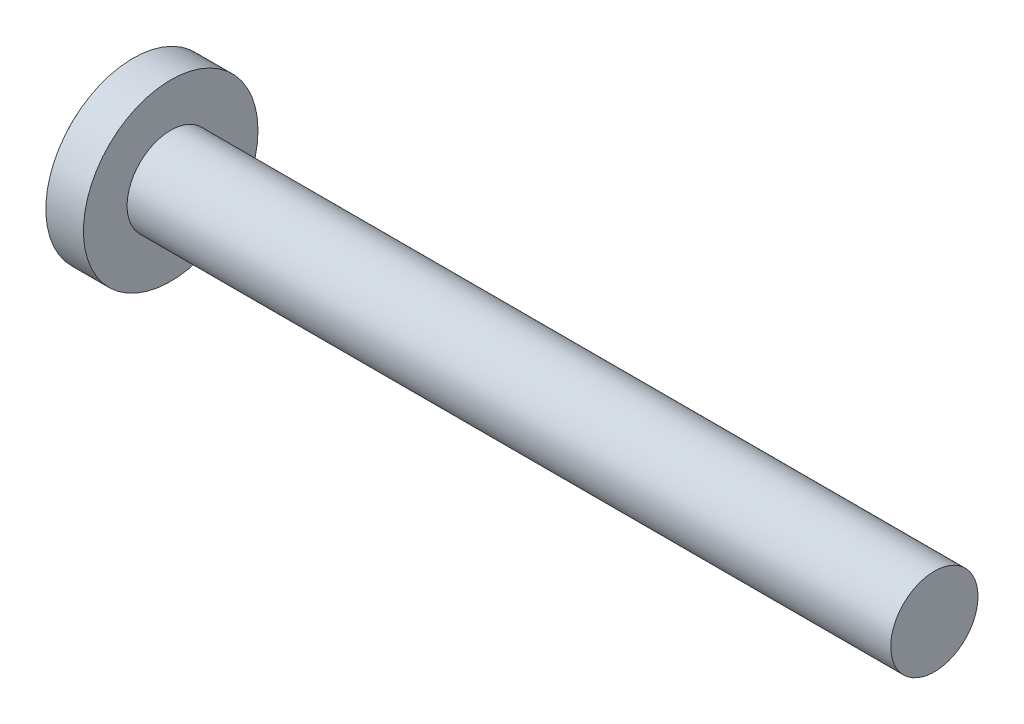
ISO-10303-21;
HEADER;
FILE_DESCRIPTION(('STEP AP214'),'2;1');
FILE_NAME('part.step','',(''),(''),'','','');
FILE_SCHEMA(('AUTOMOTIVE_DESIGN { 1 0 10303 214 1 1 1 1 }'));
ENDSEC;
DATA;
#1=APPLICATION_CONTEXT('core data for automotive mechanical design processes');
#2=APPLICATION_PROTOCOL_DEFINITION('international standard','automotive_design',2000,#1);
#3=PRODUCT_CONTEXT('',#1,'mechanical');
#4=PRODUCT('Part','Part','',(#3));
#5=PRODUCT_RELATED_PRODUCT_CATEGORY('part','',(#4));
#6=PRODUCT_DEFINITION_FORMATION('','',#4);
#7=PRODUCT_DEFINITION_CONTEXT('part definition',#1,'design');
#8=PRODUCT_DEFINITION('design','',#6,#7);
#9=PRODUCT_DEFINITION_SHAPE('','',#8);
#10=(LENGTH_UNIT() NAMED_UNIT(*) SI_UNIT(.MILLI.,.METRE.));
#11=(NAMED_UNIT(*) PLANE_ANGLE_UNIT() SI_UNIT($,.RADIAN.));
#12=(NAMED_UNIT(*) SI_UNIT($,.STERADIAN.) SOLID_ANGLE_UNIT());
#13=UNCERTAINTY_MEASURE_WITH_UNIT(LENGTH_MEASURE(1.E-05),#10,'distance_accuracy_value','');
#14=(GEOMETRIC_REPRESENTATION_CONTEXT(3) GLOBAL_UNCERTAINTY_ASSIGNED_CONTEXT((#13)) GLOBAL_UNIT_ASSIGNED_CONTEXT((#10,
#11,#12)) REPRESENTATION_CONTEXT('',''));
#15=CARTESIAN_POINT('',(0.,0.,0.));
#16=DIRECTION('',(0.,0.,1.));
#17=DIRECTION('',(1.,0.,0.));
#18=AXIS2_PLACEMENT_3D('',#15,#16,#17);
#19=CARTESIAN_POINT('',(6.5,0.,0.));
#20=DIRECTION('',(1.,0.,0.));
#21=DIRECTION('',(0.,1.,0.));
#22=AXIS2_PLACEMENT_3D('',#19,#20,#21);
#23=SPHERICAL_SURFACE('',#22,6.5);
#24=CARTESIAN_POINT('',(1.3765246170202,0.,0.));
#25=DIRECTION('',(1.,0.,0.));
#26=DIRECTION('',(0.,0.,-1.));
#27=AXIS2_PLACEMENT_3D('',#24,#25,#26);
#28=CIRCLE('',#27,4.);
#29=CARTESIAN_POINT('',(1.3765246170202,0.,-4.));
#30=VERTEX_POINT('',#29);
#31=EDGE_CURVE('E152',#30,#30,#28,.T.);
#32=ORIENTED_EDGE('',*,*,#31,.F.);
#33=EDGE_LOOP('',(#32));
#34=FACE_BOUND('',#33,.T.);
#35=CARTESIAN_POINT('',(6.5,-0.44,0.));
#36=DIRECTION('',(0.,1.,0.));
#37=DIRECTION('',(0.,0.,1.));
#38=AXIS2_PLACEMENT_3D('',#35,#36,#37);
#39=CIRCLE('',#38,6.48509059304494);
#40=CARTESIAN_POINT('',(0.333444887912563,-0.440000000000001,2.00748550420378));
#41=VERTEX_POINT('',#40);
#42=CARTESIAN_POINT('',(0.0572676603788676,-0.44,0.74));
#43=VERTEX_POINT('',#42);
#44=EDGE_CURVE('E235',#41,#43,#39,.F.);
#45=ORIENTED_EDGE('',*,*,#44,.T.);
#46=CARTESIAN_POINT('',(0.0572676603788676,-0.44,0.74));
#47=CARTESIAN_POINT('',(0.0553459095034022,-0.439985341253235,0.72328305296714));
#48=CARTESIAN_POINT('',(0.0535867486844841,-0.441396550947806,0.706548480277779));
#49=CARTESIAN_POINT('',(0.0504373840847348,-0.446984059228203,0.673519044256814));
#50=CARTESIAN_POINT('',(0.0490470236842149,-0.451159181412456,0.657223996920084));
#51=CARTESIAN_POINT('',(0.046676420761246,-0.462192225889046,0.625521412589929));
#52=CARTESIAN_POINT('',(0.0456964933382919,-0.469052201622536,0.610114565285909));
#53=CARTESIAN_POINT('',(0.0441774835674314,-0.485262357640217,0.580654009149766));
#54=CARTESIAN_POINT('',(0.0436382629946529,-0.494611755912349,0.566599877268183));
#55=CARTESIAN_POINT('',(0.0430188919704429,-0.515464220625997,0.540343256526173));
#56=CARTESIAN_POINT('',(0.0429355253534814,-0.526951606000225,0.528128388224688));
#57=CARTESIAN_POINT('',(0.0432217527040643,-0.551797332001338,0.505780157883181));
#58=CARTESIAN_POINT('',(0.0435914161120777,-0.565155959174266,0.49564711522353));
#59=CARTESIAN_POINT('',(0.0447707140747336,-0.593313108529131,0.477778249110346));
#60=CARTESIAN_POINT('',(0.0455789968290611,-0.608107092571906,0.470035174343328));
#61=CARTESIAN_POINT('',(0.0476108904953499,-0.638747141176103,0.457114889529338));
#62=CARTESIAN_POINT('',(0.0488343419884252,-0.65459280003348,0.451936696478722));
#63=CARTESIAN_POINT('',(0.0512407906304834,-0.682094193797786,0.445409618854467));
#64=CARTESIAN_POINT('',(0.052328597772935,-0.693602036355864,0.443380984422657));
#65=CARTESIAN_POINT('',(0.0546743160010176,-0.716741634082106,0.440676069271593));
#66=CARTESIAN_POINT('',(0.0559319812556679,-0.728373188198784,0.439997856052776));
#67=CARTESIAN_POINT('',(0.0572676603788669,-0.74,0.44));
#68=B_SPLINE_CURVE_WITH_KNOTS('',3,(#46,#47,#48,#49,#50,#51,#52,#53,#54,#55,#56,#57,#58,#59,#60,
#61,#62,#63,#64,#65,#66,#67),.UNSPECIFIED.,.F.,.F.,(4,2,2,2,2,2,2,2,2,2,4),(0.,
0.0504198812115461,0.100818316040611,0.151255372379011,0.201676603381452,0.251741636319805,
0.301814344189272,0.351733600037098,0.401633709250622,0.436765534122532,0.471847047898825),.UNSPECIFIED.);
#69=CARTESIAN_POINT('',(0.0572676603788676,-0.74,0.44));
#70=VERTEX_POINT('',#69);
#71=EDGE_CURVE('E238',#43,#70,#68,.T.);
#72=ORIENTED_EDGE('',*,*,#71,.T.);
#73=CARTESIAN_POINT('',(6.5,0.,0.44));
#74=DIRECTION('',(0.,0.,-1.));
#75=DIRECTION('',(0.,1.,0.));
#76=AXIS2_PLACEMENT_3D('',#73,#74,#75);
#77=CIRCLE('',#76,6.48509059304494);
#78=CARTESIAN_POINT('',(0.333444887912564,-2.00748550420378,0.439999999999999));
#79=VERTEX_POINT('',#78);
#80=EDGE_CURVE('E246',#70,#79,#77,.F.);
#81=ORIENTED_EDGE('',*,*,#80,.T.);
#82=CARTESIAN_POINT('',(5.82762794416288,1.16458256229943,0.));
#83=DIRECTION('',(-0.500000000000001,0.866025403784438,0.));
#84=DIRECTION('',(-0.866025403784438,-0.500000000000001,0.));
#85=AXIS2_PLACEMENT_3D('',#82,#83,#84);
#86=CIRCLE('',#85,6.35937601295264);
#87=CARTESIAN_POINT('',(0.333444887912564,-2.00748550420378,-0.44));
#88=VERTEX_POINT('',#87);
#89=EDGE_CURVE('E249',#79,#88,#86,.F.);
#90=ORIENTED_EDGE('',*,*,#89,.T.);
#91=CARTESIAN_POINT('',(6.5,0.,-0.44));
#92=DIRECTION('',(0.,0.,1.));
#93=DIRECTION('',(1.,0.,0.));
#94=AXIS2_PLACEMENT_3D('',#91,#92,#93);
#95=CIRCLE('',#94,6.48509059304494);
#96=CARTESIAN_POINT('',(0.0572676603788676,-0.74,-0.44));
#97=VERTEX_POINT('',#96);
#98=EDGE_CURVE('E256',#88,#97,#95,.F.);
#99=ORIENTED_EDGE('',*,*,#98,.T.);
#100=CARTESIAN_POINT('',(0.0572676603788676,-0.74,-0.44));
#101=CARTESIAN_POINT('',(0.0553459095034013,-0.72328305296714,-0.439985341253235));
#102=CARTESIAN_POINT('',(0.0535867486844834,-0.706548480277779,-0.441396550947806));
#103=CARTESIAN_POINT('',(0.0504373840847346,-0.673519044256814,-0.446984059228203));
#104=CARTESIAN_POINT('',(0.0490470236842152,-0.657223996920084,-0.451159181412456));
#105=CARTESIAN_POINT('',(0.0466764207612456,-0.625521412589929,-0.462192225889046));
#106=CARTESIAN_POINT('',(0.0456964933382905,-0.610114565285909,-0.469052201622536));
#107=CARTESIAN_POINT('',(0.0441774835674305,-0.580654009149766,-0.485262357640217));
#108=CARTESIAN_POINT('',(0.0436382629946535,-0.566599877268183,-0.49461175591235));
#109=CARTESIAN_POINT('',(0.043018891970444,-0.540343256526173,-0.515464220625998));
#110=CARTESIAN_POINT('',(0.0429355253534814,-0.528128388224687,-0.526951606000225));
#111=CARTESIAN_POINT('',(0.0432217527040636,-0.505780157883181,-0.551797332001338));
#112=CARTESIAN_POINT('',(0.0435914161120775,-0.49564711522353,-0.565155959174266));
#113=CARTESIAN_POINT('',(0.0447707140747337,-0.477778249110346,-0.593313108529131));
#114=CARTESIAN_POINT('',(0.045578996829061,-0.470035174343328,-0.608107092571906));
#115=CARTESIAN_POINT('',(0.0476108904953498,-0.457114889529338,-0.638747141176103));
#116=CARTESIAN_POINT('',(0.0488343419884252,-0.451936696478722,-0.65459280003348));
#117=CARTESIAN_POINT('',(0.0512407906304834,-0.445409618854467,-0.682094193797787));
#118=CARTESIAN_POINT('',(0.052328597772935,-0.443380984422657,-0.693602036355865));
#119=CARTESIAN_POINT('',(0.0546743160010177,-0.440676069271593,-0.716741634082106));
#120=CARTESIAN_POINT('',(0.0559319812556679,-0.439997856052776,-0.728373188198785));
#121=CARTESIAN_POINT('',(0.0572676603788669,-0.44,-0.74));
#122=B_SPLINE_CURVE_WITH_KNOTS('',3,(#100,#101,#102,#103,#104,#105,#106,#107,#108,#109,#110,
#111,#112,#113,#114,#115,#116,#117,#118,#119,#120,#121),.UNSPECIFIED.,.F.,.F.,(4,2,2,2,2,2,2,2,
2,2,4),(0.,0.0504198812115463,0.100818316040611,0.151255372379012,0.201676603381452,
0.251741636319806,0.301814344189272,0.351733600037099,0.401633709250623,0.436765534122532,
0.471847047898826),.UNSPECIFIED.);
#123=CARTESIAN_POINT('',(0.0572676603788676,-0.44,-0.74));
#124=VERTEX_POINT('',#123);
#125=EDGE_CURVE('E293',#97,#124,#122,.T.);
#126=ORIENTED_EDGE('',*,*,#125,.T.);
#127=CARTESIAN_POINT('',(6.5,-0.44,0.));
#128=DIRECTION('',(0.,1.,0.));
#129=DIRECTION('',(0.,0.,1.));
#130=AXIS2_PLACEMENT_3D('',#127,#128,#129);
#131=CIRCLE('',#130,6.48509059304494);
#132=CARTESIAN_POINT('',(0.333444887912564,-0.44,-2.00748550420378));
#133=VERTEX_POINT('',#132);
#134=EDGE_CURVE('E254',#124,#133,#131,.F.);
#135=ORIENTED_EDGE('',*,*,#134,.T.);
#136=CARTESIAN_POINT('',(5.82762794416288,0.,1.16458256229943));
#137=DIRECTION('',(-0.500000000000001,0.,0.866025403784438));
#138=DIRECTION('',(0.866025403784438,0.,0.500000000000001));
#139=AXIS2_PLACEMENT_3D('',#136,#137,#138);
#140=CIRCLE('',#139,6.35937601295264);
#141=CARTESIAN_POINT('',(0.333444887912564,0.44,-2.00748550420378));
#142=VERTEX_POINT('',#141);
#143=EDGE_CURVE('E130',#133,#142,#140,.F.);
#144=ORIENTED_EDGE('',*,*,#143,.T.);
#145=CARTESIAN_POINT('',(6.5,0.44,0.));
#146=DIRECTION('',(0.,-1.,0.));
#147=DIRECTION('',(0.,0.,-1.));
#148=AXIS2_PLACEMENT_3D('',#145,#146,#147);
#149=CIRCLE('',#148,6.48509059304494);
#150=CARTESIAN_POINT('',(0.0572676603788676,0.44,-0.74));
#151=VERTEX_POINT('',#150);
#152=EDGE_CURVE('E257',#142,#151,#149,.F.);
#153=ORIENTED_EDGE('',*,*,#152,.T.);
#154=CARTESIAN_POINT('',(0.0572676603788676,0.44,-0.74));
#155=CARTESIAN_POINT('',(0.055345909503403,0.439985341253234,-0.72328305296714));
#156=CARTESIAN_POINT('',(0.0535867486844849,0.441396550947806,-0.706548480277779));
#157=CARTESIAN_POINT('',(0.0504373840847349,0.446984059228202,-0.673519044256814));
#158=CARTESIAN_POINT('',(0.0490470236842143,0.451159181412456,-0.657223996920085));
#159=CARTESIAN_POINT('',(0.0466764207612447,0.462192225889046,-0.625521412589929));
#160=CARTESIAN_POINT('',(0.0456964933382907,0.469052201622536,-0.610114565285909));
#161=CARTESIAN_POINT('',(0.0441774835674312,0.485262357640217,-0.580654009149766));
#162=CARTESIAN_POINT('',(0.0436382629946537,0.494611755912349,-0.566599877268183));
#163=CARTESIAN_POINT('',(0.0430188919704438,0.515464220625998,-0.540343256526173));
#164=CARTESIAN_POINT('',(0.0429355253534814,0.526951606000225,-0.528128388224688));
#165=CARTESIAN_POINT('',(0.0432217527040638,0.551797332001338,-0.505780157883181));
#166=CARTESIAN_POINT('',(0.0435914161120776,0.565155959174266,-0.49564711522353));
#167=CARTESIAN_POINT('',(0.0447707140747337,0.593313108529131,-0.477778249110346));
#168=CARTESIAN_POINT('',(0.0455789968290609,0.608107092571906,-0.470035174343329));
#169=CARTESIAN_POINT('',(0.0476108904953497,0.638747141176103,-0.457114889529339));
#170=CARTESIAN_POINT('',(0.0488343419884252,0.65459280003348,-0.451936696478722));
#171=CARTESIAN_POINT('',(0.0512407906304834,0.682094193797786,-0.445409618854468));
#172=CARTESIAN_POINT('',(0.052328597772935,0.693602036355864,-0.443380984422657));
#173=CARTESIAN_POINT('',(0.0546743160010177,0.716741634082106,-0.440676069271593));
#174=CARTESIAN_POINT('',(0.0559319812556679,0.728373188198784,-0.439997856052777));
#175=CARTESIAN_POINT('',(0.0572676603788669,0.74,-0.44));
#176=B_SPLINE_CURVE_WITH_KNOTS('',3,(#154,#155,#156,#157,#158,#159,#160,#161,#162,#163,#164,
#165,#166,#167,#168,#169,#170,#171,#172,#173,#174,#175),.UNSPECIFIED.,.F.,.F.,(4,2,2,2,2,2,2,2,
2,2,4),(0.,0.0504198812115463,0.100818316040611,0.151255372379012,0.201676603381452,
0.251741636319806,0.301814344189272,0.351733600037099,0.401633709250623,0.436765534122532,
0.471847047898826),.UNSPECIFIED.);
#177=CARTESIAN_POINT('',(0.0572676603788676,0.74,-0.44));
#178=VERTEX_POINT('',#177);
#179=EDGE_CURVE('E170',#151,#178,#176,.T.);
#180=ORIENTED_EDGE('',*,*,#179,.T.);
#181=CARTESIAN_POINT('',(6.5,0.,-0.44));
#182=DIRECTION('',(0.,0.,1.));
#183=DIRECTION('',(1.,0.,0.));
#184=AXIS2_PLACEMENT_3D('',#181,#182,#183);
#185=CIRCLE('',#184,6.48509059304494);
#186=CARTESIAN_POINT('',(0.333444887912563,2.00748550420378,-0.44));
#187=VERTEX_POINT('',#186);
#188=EDGE_CURVE('E260',#178,#187,#185,.F.);
#189=ORIENTED_EDGE('',*,*,#188,.T.);
#190=CARTESIAN_POINT('',(5.82762794416288,-1.16458256229943,0.));
#191=DIRECTION('',(-0.500000000000001,-0.866025403784438,0.));
#192=DIRECTION('',(0.866025403784438,-0.500000000000001,0.));
#193=AXIS2_PLACEMENT_3D('',#190,#191,#192);
#194=CIRCLE('',#193,6.35937601295264);
#195=CARTESIAN_POINT('',(0.333444887912564,2.00748550420378,0.44));
#196=VERTEX_POINT('',#195);
#197=EDGE_CURVE('E275',#187,#196,#194,.F.);
#198=ORIENTED_EDGE('',*,*,#197,.T.);
#199=CARTESIAN_POINT('',(6.5,0.,0.44));
#200=DIRECTION('',(0.,0.,-1.));
#201=DIRECTION('',(0.,1.,0.));
#202=AXIS2_PLACEMENT_3D('',#199,#200,#201);
#203=CIRCLE('',#202,6.48509059304494);
#204=CARTESIAN_POINT('',(0.0572676603788676,0.74,0.44));
#205=VERTEX_POINT('',#204);
#206=EDGE_CURVE('E166',#196,#205,#203,.F.);
#207=ORIENTED_EDGE('',*,*,#206,.T.);
#208=CARTESIAN_POINT('',(0.0572676603788676,0.74,0.44));
#209=CARTESIAN_POINT('',(0.0553459095034034,0.72328305296714,0.439985341253234));
#210=CARTESIAN_POINT('',(0.0535867486844853,0.706548480277779,0.441396550947806));
#211=CARTESIAN_POINT('',(0.0504373840847352,0.673519044256814,0.446984059228202));
#212=CARTESIAN_POINT('',(0.0490470236842145,0.657223996920085,0.451159181412456));
#213=CARTESIAN_POINT('',(0.0466764207612446,0.625521412589929,0.462192225889046));
#214=CARTESIAN_POINT('',(0.0456964933382903,0.610114565285909,0.469052201622536));
#215=CARTESIAN_POINT('',(0.0441774835674304,0.580654009149766,0.485262357640217));
#216=CARTESIAN_POINT('',(0.0436382629946526,0.566599877268183,0.494611755912349));
#217=CARTESIAN_POINT('',(0.0430188919704432,0.540343256526173,0.515464220625997));
#218=CARTESIAN_POINT('',(0.0429355253534816,0.528128388224688,0.526951606000225));
#219=CARTESIAN_POINT('',(0.0432217527040643,0.505780157883181,0.551797332001338));
#220=CARTESIAN_POINT('',(0.0435914161120777,0.49564711522353,0.565155959174266));
#221=CARTESIAN_POINT('',(0.0447707140747336,0.477778249110346,0.593313108529131));
#222=CARTESIAN_POINT('',(0.045578996829061,0.470035174343329,0.608107092571906));
#223=CARTESIAN_POINT('',(0.0476108904953499,0.457114889529338,0.638747141176103));
#224=CARTESIAN_POINT('',(0.0488343419884252,0.451936696478722,0.65459280003348));
#225=CARTESIAN_POINT('',(0.0512407906304834,0.445409618854468,0.682094193797786));
#226=CARTESIAN_POINT('',(0.052328597772935,0.443380984422657,0.693602036355864));
#227=CARTESIAN_POINT('',(0.0546743160010176,0.440676069271593,0.716741634082106));
#228=CARTESIAN_POINT('',(0.0559319812556678,0.439997856052776,0.728373188198784));
#229=CARTESIAN_POINT('',(0.0572676603788669,0.44,0.74));
#230=B_SPLINE_CURVE_WITH_KNOTS('',3,(#208,#209,#210,#211,#212,#213,#214,#215,#216,#217,#218,
#219,#220,#221,#222,#223,#224,#225,#226,#227,#228,#229),.UNSPECIFIED.,.F.,.F.,(4,2,2,2,2,2,2,2,
2,2,4),(0.,0.0504198812115462,0.100818316040611,0.151255372379012,0.201676603381452,
0.251741636319806,0.301814344189272,0.351733600037098,0.401633709250622,0.436765534122532,
0.471847047898826),.UNSPECIFIED.);
#231=CARTESIAN_POINT('',(0.0572676603788676,0.44,0.74));
#232=VERTEX_POINT('',#231);
#233=EDGE_CURVE('E180',#205,#232,#230,.T.);
#234=ORIENTED_EDGE('',*,*,#233,.T.);
#235=CARTESIAN_POINT('',(6.5,0.44,0.));
#236=DIRECTION('',(0.,-1.,0.));
#237=DIRECTION('',(0.,0.,-1.));
#238=AXIS2_PLACEMENT_3D('',#235,#236,#237);
#239=CIRCLE('',#238,6.48509059304494);
#240=CARTESIAN_POINT('',(0.333444887912564,0.44,2.00748550420378));
#241=VERTEX_POINT('',#240);
#242=EDGE_CURVE('E171',#232,#241,#239,.F.);
#243=ORIENTED_EDGE('',*,*,#242,.T.);
#244=CARTESIAN_POINT('',(5.82762794416288,0.,-1.16458256229943));
#245=DIRECTION('',(-0.500000000000001,0.,-0.866025403784438));
#246=DIRECTION('',(-0.866025403784438,0.,0.500000000000001));
#247=AXIS2_PLACEMENT_3D('',#244,#245,#246);
#248=CIRCLE('',#247,6.35937601295264);
#249=EDGE_CURVE('E241',#241,#41,#248,.F.);
#250=ORIENTED_EDGE('',*,*,#249,.T.);
#251=EDGE_LOOP('',(#45,#72,#81,#90,#99,#126,#135,#144,#153,#180,#189,#198,#207,#234,#243,#250));
#252=FACE_BOUND('',#251,.T.);
#253=ADVANCED_FACE('F37',(#34,#252),#23,.T.);
#254=CARTESIAN_POINT('',(38.1,2.,0.));
#255=DIRECTION('',(1.,0.,0.));
#256=DIRECTION('',(0.,0.,-1.));
#257=AXIS2_PLACEMENT_3D('',#254,#255,#256);
#258=PLANE('',#257);
#259=CARTESIAN_POINT('',(38.1,0.,0.));
#260=DIRECTION('',(1.,0.,0.));
#261=DIRECTION('',(0.,0.,-1.));
#262=AXIS2_PLACEMENT_3D('',#259,#260,#261);
#263=CIRCLE('',#262,2.);
#264=CARTESIAN_POINT('',(38.1,0.,-2.));
#265=VERTEX_POINT('',#264);
#266=EDGE_CURVE('E163',#265,#265,#263,.T.);
#267=ORIENTED_EDGE('',*,*,#266,.T.);
#268=EDGE_LOOP('',(#267));
#269=FACE_BOUND('',#268,.T.);
#270=ADVANCED_FACE('F221',(#269),#258,.T.);
#271=CARTESIAN_POINT('',(4.51581291088132,0.,0.));
#272=DIRECTION('',(1.,0.,0.));
#273=DIRECTION('',(0.,0.,-1.));
#274=AXIS2_PLACEMENT_3D('',#271,#272,#273);
#275=CYLINDRICAL_SURFACE('',#274,2.);
#276=CARTESIAN_POINT('',(3.1,0.,0.));
#277=DIRECTION('',(1.,0.,0.));
#278=DIRECTION('',(0.,0.,-1.));
#279=AXIS2_PLACEMENT_3D('',#276,#277,#278);
#280=CIRCLE('',#279,2.);
#281=CARTESIAN_POINT('',(3.1,0.,-2.));
#282=VERTEX_POINT('',#281);
#283=EDGE_CURVE('E160',#282,#282,#280,.T.);
#284=ORIENTED_EDGE('',*,*,#283,.T.);
#285=EDGE_LOOP('',(#284));
#286=FACE_BOUND('',#285,.T.);
#287=ORIENTED_EDGE('',*,*,#266,.F.);
#288=EDGE_LOOP('',(#287));
#289=FACE_BOUND('',#288,.T.);
#290=ADVANCED_FACE('F226',(#286,#289),#275,.T.);
#291=CARTESIAN_POINT('',(3.1,2.35,0.));
#292=DIRECTION('',(1.,0.,0.));
#293=DIRECTION('',(0.,0.,-1.));
#294=AXIS2_PLACEMENT_3D('',#291,#292,#293);
#295=PLANE('',#294);
#296=CARTESIAN_POINT('',(3.1,0.,0.));
#297=DIRECTION('',(1.,0.,0.));
#298=DIRECTION('',(0.,0.,-1.));
#299=AXIS2_PLACEMENT_3D('',#296,#297,#298);
#300=CIRCLE('',#299,4.);
#301=CARTESIAN_POINT('',(3.1,0.,-4.));
#302=VERTEX_POINT('',#301);
#303=EDGE_CURVE('E155',#302,#302,#300,.T.);
#304=ORIENTED_EDGE('',*,*,#303,.T.);
#305=EDGE_LOOP('',(#304));
#306=FACE_BOUND('',#305,.T.);
#307=ORIENTED_EDGE('',*,*,#283,.F.);
#308=EDGE_LOOP('',(#307));
#309=FACE_BOUND('',#308,.T.);
#310=ADVANCED_FACE('F363',(#306,#309),#295,.T.);
#311=CARTESIAN_POINT('',(4.51581291088132,0.,0.));
#312=DIRECTION('',(1.,0.,0.));
#313=DIRECTION('',(0.,0.,-1.));
#314=AXIS2_PLACEMENT_3D('',#311,#312,#313);
#315=CYLINDRICAL_SURFACE('',#314,4.);
#316=ORIENTED_EDGE('',*,*,#31,.T.);
#317=EDGE_LOOP('',(#316));
#318=FACE_BOUND('',#317,.T.);
#319=ORIENTED_EDGE('',*,*,#303,.F.);
#320=EDGE_LOOP('',(#319));
#321=FACE_BOUND('',#320,.T.);
#322=ADVANCED_FACE('F217',(#318,#321),#315,.T.);
#323=CARTESIAN_POINT('',(2.17,0.44,0.44));
#324=DIRECTION('',(0.,-1.,0.));
#325=DIRECTION('',(0.,0.,-1.));
#326=AXIS2_PLACEMENT_3D('',#323,#324,#325);
#327=PLANE('',#326);
#328=ORIENTED_EDGE('',*,*,#242,.F.);
#329=DIRECTION('',(-1.,0.,0.));
#330=VECTOR('',#329,1.);
#331=CARTESIAN_POINT('',(2.17,0.44,0.74));
#332=LINE('',#331,#330);
#333=CARTESIAN_POINT('',(2.17,0.44,0.74));
#334=VERTEX_POINT('',#333);
#335=EDGE_CURVE('E305',#232,#334,#332,.F.);
#336=ORIENTED_EDGE('',*,*,#335,.T.);
#337=DIRECTION('',(0.,0.,1.));
#338=VECTOR('',#337,1.);
#339=CARTESIAN_POINT('',(2.17,0.44,0.44));
#340=LINE('',#339,#338);
#341=CARTESIAN_POINT('',(2.17,0.44,0.947149915858509));
#342=VERTEX_POINT('',#341);
#343=EDGE_CURVE('E286',#334,#342,#340,.T.);
#344=ORIENTED_EDGE('',*,*,#343,.T.);
#345=DIRECTION('',(-0.866025403784438,0.,0.500000000000001));
#346=VECTOR('',#345,1.);
#347=CARTESIAN_POINT('',(0.,0.44,2.2));
#348=LINE('',#347,#346);
#349=EDGE_CURVE('E156',#342,#241,#348,.T.);
#350=ORIENTED_EDGE('',*,*,#349,.T.);
#351=EDGE_LOOP('',(#328,#336,#344,#350));
#352=FACE_BOUND('',#351,.T.);
#353=ADVANCED_FACE('F209',(#352),#327,.T.);
#354=CARTESIAN_POINT('',(0.,0.,2.2));
#355=DIRECTION('',(-0.500000000000001,0.,-0.866025403784438));
#356=DIRECTION('',(-0.866025403784438,0.,0.500000000000001));
#357=AXIS2_PLACEMENT_3D('',#354,#355,#356);
#358=PLANE('',#357);
#359=ORIENTED_EDGE('',*,*,#349,.F.);
#360=DIRECTION('',(0.,-1.,0.));
#361=VECTOR('',#360,1.);
#362=CARTESIAN_POINT('',(2.17,0.,0.947149915858508));
#363=LINE('',#362,#361);
#364=CARTESIAN_POINT('',(2.17,-0.44,0.947149915858508));
#365=VERTEX_POINT('',#364);
#366=EDGE_CURVE('E284',#342,#365,#363,.T.);
#367=ORIENTED_EDGE('',*,*,#366,.T.);
#368=DIRECTION('',(-0.866025403784438,0.,0.500000000000001));
#369=VECTOR('',#368,1.);
#370=CARTESIAN_POINT('',(2.38960235533031,-0.44,0.82036243689388));
#371=LINE('',#370,#369);
#372=EDGE_CURVE('E264',#365,#41,#371,.T.);
#373=ORIENTED_EDGE('',*,*,#372,.T.);
#374=ORIENTED_EDGE('',*,*,#249,.F.);
#375=EDGE_LOOP('',(#359,#367,#373,#374));
#376=FACE_BOUND('',#375,.T.);
#377=ADVANCED_FACE('F206',(#376),#358,.T.);
#378=CARTESIAN_POINT('',(2.17,-0.44,0.44));
#379=DIRECTION('',(0.,1.,0.));
#380=DIRECTION('',(0.,0.,1.));
#381=AXIS2_PLACEMENT_3D('',#378,#379,#380);
#382=PLANE('',#381);
#383=DIRECTION('',(0.,0.,-1.));
#384=VECTOR('',#383,1.);
#385=CARTESIAN_POINT('',(2.17,-0.44,0.44));
#386=LINE('',#385,#384);
#387=CARTESIAN_POINT('',(2.17,-0.44,0.74));
#388=VERTEX_POINT('',#387);
#389=EDGE_CURVE('E285',#365,#388,#386,.T.);
#390=ORIENTED_EDGE('',*,*,#389,.T.);
#391=DIRECTION('',(-1.,0.,0.));
#392=VECTOR('',#391,1.);
#393=CARTESIAN_POINT('',(2.17,-0.44,0.74));
#394=LINE('',#393,#392);
#395=EDGE_CURVE('E167',#388,#43,#394,.T.);
#396=ORIENTED_EDGE('',*,*,#395,.T.);
#397=ORIENTED_EDGE('',*,*,#44,.F.);
#398=ORIENTED_EDGE('',*,*,#372,.F.);
#399=EDGE_LOOP('',(#390,#396,#397,#398));
#400=FACE_BOUND('',#399,.T.);
#401=ADVANCED_FACE('F208',(#400),#382,.T.);
#402=CARTESIAN_POINT('',(2.17,-0.44,0.44));
#403=DIRECTION('',(0.,0.,-1.));
#404=DIRECTION('',(0.,1.,0.));
#405=AXIS2_PLACEMENT_3D('',#402,#403,#404);
#406=PLANE('',#405);
#407=ORIENTED_EDGE('',*,*,#80,.F.);
#408=DIRECTION('',(-1.,0.,0.));
#409=VECTOR('',#408,1.);
#410=CARTESIAN_POINT('',(2.17,-0.74,0.44));
#411=LINE('',#410,#409);
#412=CARTESIAN_POINT('',(2.17,-0.74,0.44));
#413=VERTEX_POINT('',#412);
#414=EDGE_CURVE('E307',#70,#413,#411,.F.);
#415=ORIENTED_EDGE('',*,*,#414,.T.);
#416=DIRECTION('',(0.,-1.,0.));
#417=VECTOR('',#416,1.);
#418=CARTESIAN_POINT('',(2.17,-0.44,0.44));
#419=LINE('',#418,#417);
#420=CARTESIAN_POINT('',(2.17,-0.947149915858508,0.44));
#421=VERTEX_POINT('',#420);
#422=EDGE_CURVE('E271',#413,#421,#419,.T.);
#423=ORIENTED_EDGE('',*,*,#422,.T.);
#424=DIRECTION('',(-0.866025403784438,-0.500000000000001,0.));
#425=VECTOR('',#424,1.);
#426=CARTESIAN_POINT('',(0.,-2.2,0.439999999999999));
#427=LINE('',#426,#425);
#428=EDGE_CURVE('E261',#421,#79,#427,.T.);
#429=ORIENTED_EDGE('',*,*,#428,.T.);
#430=EDGE_LOOP('',(#407,#415,#423,#429));
#431=FACE_BOUND('',#430,.T.);
#432=ADVANCED_FACE('F202',(#431),#406,.T.);
#433=CARTESIAN_POINT('',(0.,-2.2,0.));
#434=DIRECTION('',(-0.500000000000001,0.866025403784438,0.));
#435=DIRECTION('',(-0.866025403784438,-0.500000000000001,0.));
#436=AXIS2_PLACEMENT_3D('',#433,#434,#435);
#437=PLANE('',#436);
#438=ORIENTED_EDGE('',*,*,#428,.F.);
#439=DIRECTION('',(0.,0.,-1.));
#440=VECTOR('',#439,1.);
#441=CARTESIAN_POINT('',(2.17,-0.947149915858508,0.));
#442=LINE('',#441,#440);
#443=CARTESIAN_POINT('',(2.17,-0.947149915858509,-0.44));
#444=VERTEX_POINT('',#443);
#445=EDGE_CURVE('E269',#421,#444,#442,.T.);
#446=ORIENTED_EDGE('',*,*,#445,.T.);
#447=DIRECTION('',(-0.866025403784438,-0.500000000000001,0.));
#448=VECTOR('',#447,1.);
#449=CARTESIAN_POINT('',(2.38960235533031,-0.820362436893881,-0.44));
#450=LINE('',#449,#448);
#451=EDGE_CURVE('E131',#444,#88,#450,.T.);
#452=ORIENTED_EDGE('',*,*,#451,.T.);
#453=ORIENTED_EDGE('',*,*,#89,.F.);
#454=EDGE_LOOP('',(#438,#446,#452,#453));
#455=FACE_BOUND('',#454,.T.);
#456=ADVANCED_FACE('F198',(#455),#437,.T.);
#457=CARTESIAN_POINT('',(2.17,-0.44,-0.44));
#458=DIRECTION('',(0.,0.,1.));
#459=DIRECTION('',(1.,0.,0.));
#460=AXIS2_PLACEMENT_3D('',#457,#458,#459);
#461=PLANE('',#460);
#462=DIRECTION('',(0.,1.,0.));
#463=VECTOR('',#462,1.);
#464=CARTESIAN_POINT('',(2.17,-0.44,-0.44));
#465=LINE('',#464,#463);
#466=CARTESIAN_POINT('',(2.17,-0.74,-0.44));
#467=VERTEX_POINT('',#466);
#468=EDGE_CURVE('E125',#444,#467,#465,.T.);
#469=ORIENTED_EDGE('',*,*,#468,.T.);
#470=DIRECTION('',(-1.,0.,0.));
#471=VECTOR('',#470,1.);
#472=CARTESIAN_POINT('',(2.17,-0.74,-0.44));
#473=LINE('',#472,#471);
#474=EDGE_CURVE('E302',#467,#97,#473,.T.);
#475=ORIENTED_EDGE('',*,*,#474,.T.);
#476=ORIENTED_EDGE('',*,*,#98,.F.);
#477=ORIENTED_EDGE('',*,*,#451,.F.);
#478=EDGE_LOOP('',(#469,#475,#476,#477));
#479=FACE_BOUND('',#478,.T.);
#480=ADVANCED_FACE('F201',(#479),#461,.T.);
#481=CARTESIAN_POINT('',(2.17,-0.44,-0.44));
#482=DIRECTION('',(0.,1.,0.));
#483=DIRECTION('',(0.,0.,1.));
#484=AXIS2_PLACEMENT_3D('',#481,#482,#483);
#485=PLANE('',#484);
#486=ORIENTED_EDGE('',*,*,#134,.F.);
#487=DIRECTION('',(-1.,0.,0.));
#488=VECTOR('',#487,1.);
#489=CARTESIAN_POINT('',(2.17,-0.44,-0.74));
#490=LINE('',#489,#488);
#491=CARTESIAN_POINT('',(2.17,-0.44,-0.74));
#492=VERTEX_POINT('',#491);
#493=EDGE_CURVE('E121',#124,#492,#490,.F.);
#494=ORIENTED_EDGE('',*,*,#493,.T.);
#495=DIRECTION('',(0.,0.,-1.));
#496=VECTOR('',#495,1.);
#497=CARTESIAN_POINT('',(2.17,-0.44,-0.44));
#498=LINE('',#497,#496);
#499=CARTESIAN_POINT('',(2.17,-0.44,-0.947149915858509));
#500=VERTEX_POINT('',#499);
#501=EDGE_CURVE('E115',#492,#500,#498,.T.);
#502=ORIENTED_EDGE('',*,*,#501,.T.);
#503=DIRECTION('',(-0.866025403784438,0.,-0.500000000000001));
#504=VECTOR('',#503,1.);
#505=CARTESIAN_POINT('',(0.,-0.44,-2.2));
#506=LINE('',#505,#504);
#507=EDGE_CURVE('E118',#500,#133,#506,.T.);
#508=ORIENTED_EDGE('',*,*,#507,.T.);
#509=EDGE_LOOP('',(#486,#494,#502,#508));
#510=FACE_BOUND('',#509,.T.);
#511=ADVANCED_FACE('F117',(#510),#485,.T.);
#512=CARTESIAN_POINT('',(0.,0.,-2.2));
#513=DIRECTION('',(-0.500000000000001,0.,0.866025403784438));
#514=DIRECTION('',(0.866025403784438,0.,0.500000000000001));
#515=AXIS2_PLACEMENT_3D('',#512,#513,#514);
#516=PLANE('',#515);
#517=ORIENTED_EDGE('',*,*,#507,.F.);
#518=DIRECTION('',(0.,1.,0.));
#519=VECTOR('',#518,1.);
#520=CARTESIAN_POINT('',(2.17,0.,-0.947149915858509));
#521=LINE('',#520,#519);
#522=CARTESIAN_POINT('',(2.17,0.44,-0.947149915858509));
#523=VERTEX_POINT('',#522);
#524=EDGE_CURVE('E41',#500,#523,#521,.T.);
#525=ORIENTED_EDGE('',*,*,#524,.T.);
#526=DIRECTION('',(-0.866025403784438,0.,-0.500000000000001));
#527=VECTOR('',#526,1.);
#528=CARTESIAN_POINT('',(2.38960235533031,0.44,-0.820362436893881));
#529=LINE('',#528,#527);
#530=EDGE_CURVE('E132',#523,#142,#529,.T.);
#531=ORIENTED_EDGE('',*,*,#530,.T.);
#532=ORIENTED_EDGE('',*,*,#143,.F.);
#533=EDGE_LOOP('',(#517,#525,#531,#532));
#534=FACE_BOUND('',#533,.T.);
#535=ADVANCED_FACE('F128',(#534),#516,.T.);
#536=CARTESIAN_POINT('',(2.17,0.44,-0.44));
#537=DIRECTION('',(0.,-1.,0.));
#538=DIRECTION('',(0.,0.,-1.));
#539=AXIS2_PLACEMENT_3D('',#536,#537,#538);
#540=PLANE('',#539);
#541=DIRECTION('',(0.,0.,1.));
#542=VECTOR('',#541,1.);
#543=CARTESIAN_POINT('',(2.17,0.44,-0.44));
#544=LINE('',#543,#542);
#545=CARTESIAN_POINT('',(2.17,0.44,-0.74));
#546=VERTEX_POINT('',#545);
#547=EDGE_CURVE('E138',#523,#546,#544,.T.);
#548=ORIENTED_EDGE('',*,*,#547,.T.);
#549=DIRECTION('',(-1.,0.,0.));
#550=VECTOR('',#549,1.);
#551=CARTESIAN_POINT('',(2.17,0.44,-0.74));
#552=LINE('',#551,#550);
#553=EDGE_CURVE('E313',#546,#151,#552,.T.);
#554=ORIENTED_EDGE('',*,*,#553,.T.);
#555=ORIENTED_EDGE('',*,*,#152,.F.);
#556=ORIENTED_EDGE('',*,*,#530,.F.);
#557=EDGE_LOOP('',(#548,#554,#555,#556));
#558=FACE_BOUND('',#557,.T.);
#559=ADVANCED_FACE('F205',(#558),#540,.T.);
#560=CARTESIAN_POINT('',(2.17,0.44,-0.44));
#561=DIRECTION('',(0.,0.,1.));
#562=DIRECTION('',(1.,0.,0.));
#563=AXIS2_PLACEMENT_3D('',#560,#561,#562);
#564=PLANE('',#563);
#565=ORIENTED_EDGE('',*,*,#188,.F.);
#566=DIRECTION('',(-1.,0.,0.));
#567=VECTOR('',#566,1.);
#568=CARTESIAN_POINT('',(2.17,0.74,-0.44));
#569=LINE('',#568,#567);
#570=CARTESIAN_POINT('',(2.17,0.74,-0.44));
#571=VERTEX_POINT('',#570);
#572=EDGE_CURVE('E56',#178,#571,#569,.F.);
#573=ORIENTED_EDGE('',*,*,#572,.T.);
#574=DIRECTION('',(0.,1.,0.));
#575=VECTOR('',#574,1.);
#576=CARTESIAN_POINT('',(2.17,0.44,-0.44));
#577=LINE('',#576,#575);
#578=CARTESIAN_POINT('',(2.17,0.947149915858509,-0.44));
#579=VERTEX_POINT('',#578);
#580=EDGE_CURVE('E139',#571,#579,#577,.T.);
#581=ORIENTED_EDGE('',*,*,#580,.T.);
#582=DIRECTION('',(-0.866025403784438,0.500000000000001,0.));
#583=VECTOR('',#582,1.);
#584=CARTESIAN_POINT('',(0.,2.2,-0.44));
#585=LINE('',#584,#583);
#586=EDGE_CURVE('E272',#579,#187,#585,.T.);
#587=ORIENTED_EDGE('',*,*,#586,.T.);
#588=EDGE_LOOP('',(#565,#573,#581,#587));
#589=FACE_BOUND('',#588,.T.);
#590=ADVANCED_FACE('F444',(#589),#564,.T.);
#591=CARTESIAN_POINT('',(0.,2.2,0.));
#592=DIRECTION('',(-0.500000000000001,-0.866025403784438,0.));
#593=DIRECTION('',(0.866025403784438,-0.500000000000001,0.));
#594=AXIS2_PLACEMENT_3D('',#591,#592,#593);
#595=PLANE('',#594);
#596=ORIENTED_EDGE('',*,*,#586,.F.);
#597=DIRECTION('',(0.,0.,1.));
#598=VECTOR('',#597,1.);
#599=CARTESIAN_POINT('',(2.17,0.947149915858508,0.));
#600=LINE('',#599,#598);
#601=CARTESIAN_POINT('',(2.17,0.947149915858509,0.44));
#602=VERTEX_POINT('',#601);
#603=EDGE_CURVE('E144',#579,#602,#600,.T.);
#604=ORIENTED_EDGE('',*,*,#603,.T.);
#605=DIRECTION('',(-0.866025403784438,0.500000000000001,0.));
#606=VECTOR('',#605,1.);
#607=CARTESIAN_POINT('',(2.38960235533031,0.820362436893881,0.44));
#608=LINE('',#607,#606);
#609=EDGE_CURVE('E151',#602,#196,#608,.T.);
#610=ORIENTED_EDGE('',*,*,#609,.T.);
#611=ORIENTED_EDGE('',*,*,#197,.F.);
#612=EDGE_LOOP('',(#596,#604,#610,#611));
#613=FACE_BOUND('',#612,.T.);
#614=ADVANCED_FACE('F39',(#613),#595,.T.);
#615=CARTESIAN_POINT('',(2.17,0.44,0.44));
#616=DIRECTION('',(0.,0.,-1.));
#617=DIRECTION('',(0.,1.,0.));
#618=AXIS2_PLACEMENT_3D('',#615,#616,#617);
#619=PLANE('',#618);
#620=DIRECTION('',(0.,-1.,0.));
#621=VECTOR('',#620,1.);
#622=CARTESIAN_POINT('',(2.17,0.44,0.44));
#623=LINE('',#622,#621);
#624=CARTESIAN_POINT('',(2.17,0.74,0.44));
#625=VERTEX_POINT('',#624);
#626=EDGE_CURVE('E148',#602,#625,#623,.T.);
#627=ORIENTED_EDGE('',*,*,#626,.T.);
#628=DIRECTION('',(-1.,0.,0.));
#629=VECTOR('',#628,1.);
#630=CARTESIAN_POINT('',(2.17,0.74,0.44));
#631=LINE('',#630,#629);
#632=EDGE_CURVE('E301',#625,#205,#631,.T.);
#633=ORIENTED_EDGE('',*,*,#632,.T.);
#634=ORIENTED_EDGE('',*,*,#206,.F.);
#635=ORIENTED_EDGE('',*,*,#609,.F.);
#636=EDGE_LOOP('',(#627,#633,#634,#635));
#637=FACE_BOUND('',#636,.T.);
#638=ADVANCED_FACE('F332',(#637),#619,.T.);
#639=CARTESIAN_POINT('',(2.17,0.44,0.44));
#640=DIRECTION('',(1.,0.,0.));
#641=DIRECTION('',(0.,0.,-1.));
#642=AXIS2_PLACEMENT_3D('',#639,#640,#641);
#643=PLANE('',#642);
#644=ORIENTED_EDGE('',*,*,#343,.F.);
#645=CARTESIAN_POINT('',(2.17,0.74,0.74));
#646=DIRECTION('',(1.,0.,0.));
#647=DIRECTION('',(0.,0.,-1.));
#648=AXIS2_PLACEMENT_3D('',#645,#646,#647);
#649=CIRCLE('',#648,0.3);
#650=EDGE_CURVE('E47',#334,#625,#649,.T.);
#651=ORIENTED_EDGE('',*,*,#650,.T.);
#652=ORIENTED_EDGE('',*,*,#626,.F.);
#653=ORIENTED_EDGE('',*,*,#603,.F.);
#654=ORIENTED_EDGE('',*,*,#580,.F.);
#655=CARTESIAN_POINT('',(2.17,0.74,-0.74));
#656=DIRECTION('',(1.,0.,0.));
#657=DIRECTION('',(0.,0.,-1.));
#658=AXIS2_PLACEMENT_3D('',#655,#656,#657);
#659=CIRCLE('',#658,0.3);
#660=EDGE_CURVE('E11',#571,#546,#659,.T.);
#661=ORIENTED_EDGE('',*,*,#660,.T.);
#662=ORIENTED_EDGE('',*,*,#547,.F.);
#663=ORIENTED_EDGE('',*,*,#524,.F.);
#664=ORIENTED_EDGE('',*,*,#501,.F.);
#665=CARTESIAN_POINT('',(2.17,-0.74,-0.74));
#666=DIRECTION('',(1.,0.,0.));
#667=DIRECTION('',(0.,0.,-1.));
#668=AXIS2_PLACEMENT_3D('',#665,#666,#667);
#669=CIRCLE('',#668,0.3);
#670=EDGE_CURVE('E300',#492,#467,#669,.T.);
#671=ORIENTED_EDGE('',*,*,#670,.T.);
#672=ORIENTED_EDGE('',*,*,#468,.F.);
#673=ORIENTED_EDGE('',*,*,#445,.F.);
#674=ORIENTED_EDGE('',*,*,#422,.F.);
#675=CARTESIAN_POINT('',(2.17,-0.74,0.74));
#676=DIRECTION('',(1.,0.,0.));
#677=DIRECTION('',(0.,0.,-1.));
#678=AXIS2_PLACEMENT_3D('',#675,#676,#677);
#679=CIRCLE('',#678,0.3);
#680=EDGE_CURVE('E316',#413,#388,#679,.T.);
#681=ORIENTED_EDGE('',*,*,#680,.T.);
#682=ORIENTED_EDGE('',*,*,#389,.F.);
#683=ORIENTED_EDGE('',*,*,#366,.F.);
#684=EDGE_LOOP('',(#644,#651,#652,#653,#654,#661,#662,#663,#664,#671,#672,#673,#674,#681,#682,#683));
#685=FACE_BOUND('',#684,.T.);
#686=ADVANCED_FACE('F136',(#685),#643,.F.);
#687=CARTESIAN_POINT('',(2.17,-0.74,0.74));
#688=DIRECTION('',(-1.,0.,0.));
#689=DIRECTION('',(0.,0.,1.));
#690=AXIS2_PLACEMENT_3D('',#687,#688,#689);
#691=CYLINDRICAL_SURFACE('',#690,0.3);
#692=ORIENTED_EDGE('',*,*,#680,.F.);
#693=ORIENTED_EDGE('',*,*,#414,.F.);
#694=ORIENTED_EDGE('',*,*,#71,.F.);
#695=ORIENTED_EDGE('',*,*,#395,.F.);
#696=EDGE_LOOP('',(#692,#693,#694,#695));
#697=FACE_BOUND('',#696,.T.);
#698=ADVANCED_FACE('F356',(#697),#691,.T.);
#699=CARTESIAN_POINT('',(2.17,-0.74,-0.74));
#700=DIRECTION('',(-1.,0.,0.));
#701=DIRECTION('',(0.,0.,1.));
#702=AXIS2_PLACEMENT_3D('',#699,#700,#701);
#703=CYLINDRICAL_SURFACE('',#702,0.3);
#704=ORIENTED_EDGE('',*,*,#670,.F.);
#705=ORIENTED_EDGE('',*,*,#493,.F.);
#706=ORIENTED_EDGE('',*,*,#125,.F.);
#707=ORIENTED_EDGE('',*,*,#474,.F.);
#708=EDGE_LOOP('',(#704,#705,#706,#707));
#709=FACE_BOUND('',#708,.T.);
#710=ADVANCED_FACE('F297',(#709),#703,.T.);
#711=CARTESIAN_POINT('',(2.17,0.74,0.74));
#712=DIRECTION('',(-1.,0.,0.));
#713=DIRECTION('',(0.,0.,1.));
#714=AXIS2_PLACEMENT_3D('',#711,#712,#713);
#715=CYLINDRICAL_SURFACE('',#714,0.3);
#716=ORIENTED_EDGE('',*,*,#650,.F.);
#717=ORIENTED_EDGE('',*,*,#335,.F.);
#718=ORIENTED_EDGE('',*,*,#233,.F.);
#719=ORIENTED_EDGE('',*,*,#632,.F.);
#720=EDGE_LOOP('',(#716,#717,#718,#719));
#721=FACE_BOUND('',#720,.T.);
#722=ADVANCED_FACE('F194',(#721),#715,.T.);
#723=CARTESIAN_POINT('',(2.17,0.74,-0.74));
#724=DIRECTION('',(-1.,0.,0.));
#725=DIRECTION('',(0.,0.,1.));
#726=AXIS2_PLACEMENT_3D('',#723,#724,#725);
#727=CYLINDRICAL_SURFACE('',#726,0.3);
#728=ORIENTED_EDGE('',*,*,#660,.F.);
#729=ORIENTED_EDGE('',*,*,#572,.F.);
#730=ORIENTED_EDGE('',*,*,#179,.F.);
#731=ORIENTED_EDGE('',*,*,#553,.F.);
#732=EDGE_LOOP('',(#728,#729,#730,#731));
#733=FACE_BOUND('',#732,.T.);
#734=ADVANCED_FACE('F190',(#733),#727,.T.);
#735=CLOSED_SHELL('',(#253,#270,#290,#310,#322,#353,#377,#401,#432,#456,#480,#511,#535,#559,
#590,#614,#638,#686,#698,#710,#722,#734));
#736=MANIFOLD_SOLID_BREP('B2',#735);
#737=ADVANCED_BREP_SHAPE_REPRESENTATION('',(#18,#736),#14);
#738=SHAPE_DEFINITION_REPRESENTATION(#9,#737);
ENDSEC;
END-ISO-10303-21;
